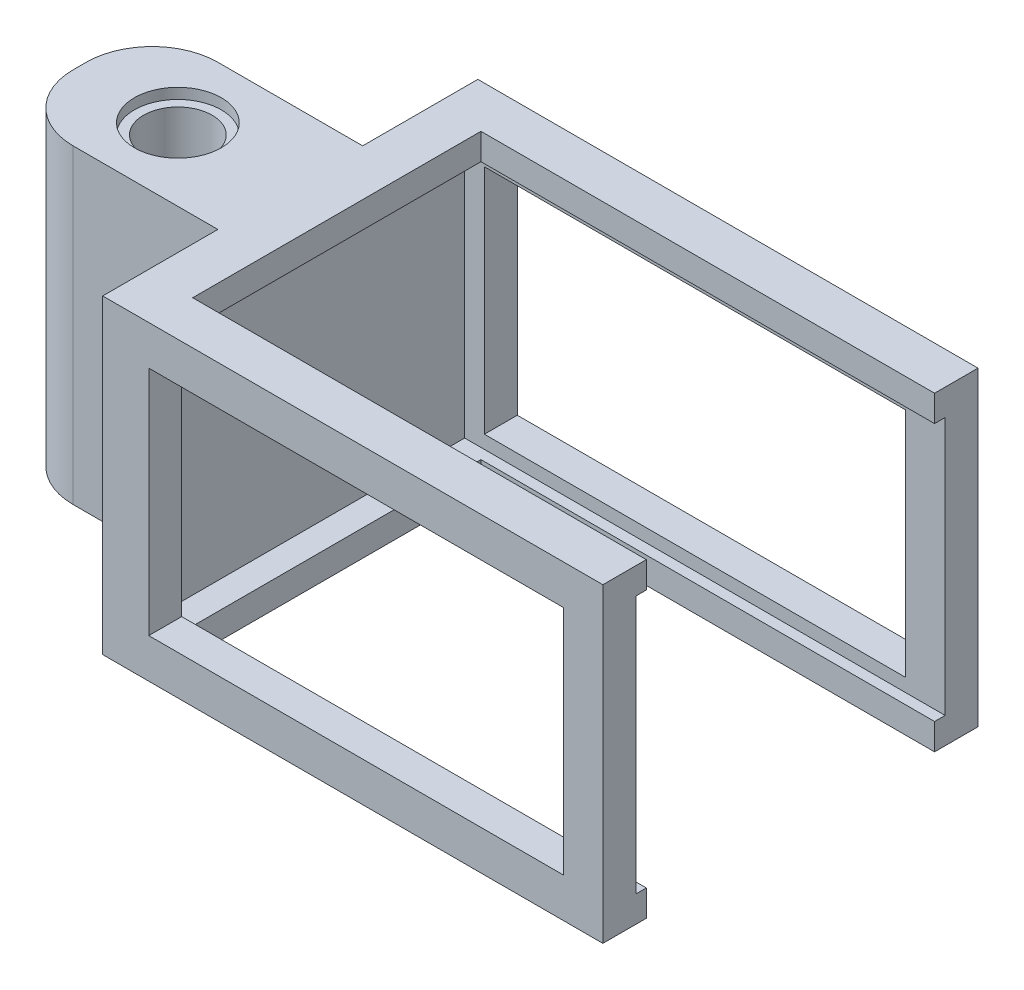
ISO-10303-21;
HEADER;
FILE_DESCRIPTION(('STEP AP214'),'2;1');
FILE_NAME('part.step','',(''),(''),'','','');
FILE_SCHEMA(('AUTOMOTIVE_DESIGN { 1 0 10303 214 1 1 1 1 }'));
ENDSEC;
DATA;
#1=APPLICATION_CONTEXT('core data for automotive mechanical design processes');
#2=APPLICATION_PROTOCOL_DEFINITION('international standard','automotive_design',2000,#1);
#3=PRODUCT_CONTEXT('',#1,'mechanical');
#4=PRODUCT('Part','Part','',(#3));
#5=PRODUCT_RELATED_PRODUCT_CATEGORY('part','',(#4));
#6=PRODUCT_DEFINITION_FORMATION('','',#4);
#7=PRODUCT_DEFINITION_CONTEXT('part definition',#1,'design');
#8=PRODUCT_DEFINITION('design','',#6,#7);
#9=PRODUCT_DEFINITION_SHAPE('','',#8);
#10=(LENGTH_UNIT() NAMED_UNIT(*) SI_UNIT(.MILLI.,.METRE.));
#11=(NAMED_UNIT(*) PLANE_ANGLE_UNIT() SI_UNIT($,.RADIAN.));
#12=(NAMED_UNIT(*) SI_UNIT($,.STERADIAN.) SOLID_ANGLE_UNIT());
#13=UNCERTAINTY_MEASURE_WITH_UNIT(LENGTH_MEASURE(1.E-05),#10,'distance_accuracy_value','');
#14=(GEOMETRIC_REPRESENTATION_CONTEXT(3) GLOBAL_UNCERTAINTY_ASSIGNED_CONTEXT((#13)) GLOBAL_UNIT_ASSIGNED_CONTEXT((#10,
#11,#12)) REPRESENTATION_CONTEXT('',''));
#15=CARTESIAN_POINT('',(0.,0.,0.));
#16=DIRECTION('',(0.,0.,1.));
#17=DIRECTION('',(1.,0.,0.));
#18=AXIS2_PLACEMENT_3D('',#15,#16,#17);
#19=CARTESIAN_POINT('',(0.,0.,2.5));
#20=DIRECTION('',(0.,0.,-1.));
#21=DIRECTION('',(-1.,0.,0.));
#22=AXIS2_PLACEMENT_3D('',#19,#20,#21);
#23=PLANE('',#22);
#24=DIRECTION('',(-1.,0.,0.));
#25=VECTOR('',#24,1.);
#26=CARTESIAN_POINT('',(38.,20.6,2.5));
#27=LINE('',#26,#25);
#28=CARTESIAN_POINT('',(35.,20.6,2.5));
#29=VERTEX_POINT('',#28);
#30=CARTESIAN_POINT('',(3.,20.6,2.5));
#31=VERTEX_POINT('',#30);
#32=EDGE_CURVE('E411',#29,#31,#27,.T.);
#33=ORIENTED_EDGE('',*,*,#32,.F.);
#34=DIRECTION('',(0.,-1.,0.));
#35=VECTOR('',#34,1.);
#36=CARTESIAN_POINT('',(35.,23.,2.5));
#37=LINE('',#36,#35);
#38=CARTESIAN_POINT('',(35.,3.,2.5));
#39=VERTEX_POINT('',#38);
#40=EDGE_CURVE('E348',#29,#39,#37,.T.);
#41=ORIENTED_EDGE('',*,*,#40,.T.);
#42=DIRECTION('',(1.,0.,0.));
#43=VECTOR('',#42,1.);
#44=CARTESIAN_POINT('',(38.,3.,2.5));
#45=LINE('',#44,#43);
#46=CARTESIAN_POINT('',(3.,3.,2.5));
#47=VERTEX_POINT('',#46);
#48=EDGE_CURVE('E415',#47,#39,#45,.T.);
#49=ORIENTED_EDGE('',*,*,#48,.F.);
#50=DIRECTION('',(0.,-1.,0.));
#51=VECTOR('',#50,1.);
#52=CARTESIAN_POINT('',(3.,20.6,2.5));
#53=LINE('',#52,#51);
#54=EDGE_CURVE('E423',#31,#47,#53,.T.);
#55=ORIENTED_EDGE('',*,*,#54,.F.);
#56=EDGE_LOOP('',(#33,#41,#49,#55));
#57=FACE_BOUND('',#56,.T.);
#58=DIRECTION('',(-1.,0.,0.));
#59=VECTOR('',#58,1.);
#60=CARTESIAN_POINT('',(0.,2.,2.5));
#61=LINE('',#60,#59);
#62=CARTESIAN_POINT('',(38.,2.,2.5));
#63=VERTEX_POINT('',#62);
#64=CARTESIAN_POINT('',(1.5,2.,2.5));
#65=VERTEX_POINT('',#64);
#66=EDGE_CURVE('E52',#63,#65,#61,.T.);
#67=ORIENTED_EDGE('',*,*,#66,.F.);
#68=DIRECTION('',(0.,1.,0.));
#69=VECTOR('',#68,1.);
#70=CARTESIAN_POINT('',(38.,0.,2.5));
#71=LINE('',#70,#69);
#72=CARTESIAN_POINT('',(38.,21.6,2.5));
#73=VERTEX_POINT('',#72);
#74=EDGE_CURVE('E432',#63,#73,#71,.T.);
#75=ORIENTED_EDGE('',*,*,#74,.T.);
#76=DIRECTION('',(1.,0.,0.));
#77=VECTOR('',#76,1.);
#78=CARTESIAN_POINT('',(0.,21.6,2.5));
#79=LINE('',#78,#77);
#80=CARTESIAN_POINT('',(1.5,21.6,2.5));
#81=VERTEX_POINT('',#80);
#82=EDGE_CURVE('E392',#81,#73,#79,.T.);
#83=ORIENTED_EDGE('',*,*,#82,.F.);
#84=DIRECTION('',(0.,1.,0.));
#85=VECTOR('',#84,1.);
#86=CARTESIAN_POINT('',(1.5,0.,2.5));
#87=LINE('',#86,#85);
#88=EDGE_CURVE('E402',#65,#81,#87,.T.);
#89=ORIENTED_EDGE('',*,*,#88,.F.);
#90=EDGE_LOOP('',(#67,#75,#83,#89));
#91=FACE_BOUND('',#90,.T.);
#92=ADVANCED_FACE('F37',(#57,#91),#23,.F.);
#93=CARTESIAN_POINT('',(3.53721509060322,-6.4,0.));
#94=DIRECTION('',(-1.,0.,0.));
#95=DIRECTION('',(0.,0.,1.));
#96=AXIS2_PLACEMENT_3D('',#93,#94,#95);
#97=PLANE('',#96);
#98=DIRECTION('',(0.,-1.,0.));
#99=VECTOR('',#98,1.);
#100=CARTESIAN_POINT('',(3.53721509060322,0.,3.3));
#101=LINE('',#100,#99);
#102=CARTESIAN_POINT('',(3.53721509060322,2.,3.3));
#103=VERTEX_POINT('',#102);
#104=CARTESIAN_POINT('',(3.53721509060322,0.,3.3));
#105=VERTEX_POINT('',#104);
#106=EDGE_CURVE('E60',#103,#105,#101,.T.);
#107=ORIENTED_EDGE('',*,*,#106,.F.);
#108=DIRECTION('',(0.,0.,-1.));
#109=VECTOR('',#108,1.);
#110=CARTESIAN_POINT('',(3.53721509060322,2.,28.5));
#111=LINE('',#110,#109);
#112=CARTESIAN_POINT('',(3.53721509060322,2.,25.2));
#113=VERTEX_POINT('',#112);
#114=EDGE_CURVE('E240',#113,#103,#111,.T.);
#115=ORIENTED_EDGE('',*,*,#114,.F.);
#116=DIRECTION('',(0.,1.,0.));
#117=VECTOR('',#116,1.);
#118=CARTESIAN_POINT('',(3.53721509060322,0.,25.2));
#119=LINE('',#118,#117);
#120=CARTESIAN_POINT('',(3.53721509060322,0.,25.2));
#121=VERTEX_POINT('',#120);
#122=EDGE_CURVE('E236',#121,#113,#119,.T.);
#123=ORIENTED_EDGE('',*,*,#122,.F.);
#124=DIRECTION('',(0.,0.,1.));
#125=VECTOR('',#124,1.);
#126=CARTESIAN_POINT('',(3.53721509060322,0.,2.5));
#127=LINE('',#126,#125);
#128=EDGE_CURVE('E232',#105,#121,#127,.T.);
#129=ORIENTED_EDGE('',*,*,#128,.F.);
#130=EDGE_LOOP('',(#107,#115,#123,#129));
#131=FACE_BOUND('',#130,.T.);
#132=ADVANCED_FACE('F234',(#131),#97,.F.);
#133=CARTESIAN_POINT('',(38.,3.,26.));
#134=DIRECTION('',(0.,0.,1.));
#135=DIRECTION('',(1.,0.,0.));
#136=AXIS2_PLACEMENT_3D('',#133,#134,#135);
#137=PLANE('',#136);
#138=DIRECTION('',(0.,-1.,0.));
#139=VECTOR('',#138,1.);
#140=CARTESIAN_POINT('',(35.,23.,26.));
#141=LINE('',#140,#139);
#142=CARTESIAN_POINT('',(35.,20.6,26.));
#143=VERTEX_POINT('',#142);
#144=CARTESIAN_POINT('',(35.,3.,26.));
#145=VERTEX_POINT('',#144);
#146=EDGE_CURVE('E342',#143,#145,#141,.T.);
#147=ORIENTED_EDGE('',*,*,#146,.F.);
#148=DIRECTION('',(1.,0.,0.));
#149=VECTOR('',#148,1.);
#150=CARTESIAN_POINT('',(0.,20.6,26.));
#151=LINE('',#150,#149);
#152=CARTESIAN_POINT('',(3.5,20.6,26.));
#153=VERTEX_POINT('',#152);
#154=EDGE_CURVE('E373',#153,#143,#151,.T.);
#155=ORIENTED_EDGE('',*,*,#154,.F.);
#156=DIRECTION('',(0.,1.,0.));
#157=VECTOR('',#156,1.);
#158=CARTESIAN_POINT('',(3.5,3.,26.));
#159=LINE('',#158,#157);
#160=CARTESIAN_POINT('',(3.5,3.,26.));
#161=VERTEX_POINT('',#160);
#162=EDGE_CURVE('E358',#161,#153,#159,.T.);
#163=ORIENTED_EDGE('',*,*,#162,.F.);
#164=DIRECTION('',(-1.,0.,0.));
#165=VECTOR('',#164,1.);
#166=CARTESIAN_POINT('',(38.,3.,26.));
#167=LINE('',#166,#165);
#168=EDGE_CURVE('E377',#145,#161,#167,.T.);
#169=ORIENTED_EDGE('',*,*,#168,.F.);
#170=EDGE_LOOP('',(#147,#155,#163,#169));
#171=FACE_BOUND('',#170,.T.);
#172=DIRECTION('',(0.,-1.,0.));
#173=VECTOR('',#172,1.);
#174=CARTESIAN_POINT('',(38.,3.,26.));
#175=LINE('',#174,#173);
#176=CARTESIAN_POINT('',(38.,21.6,26.));
#177=VERTEX_POINT('',#176);
#178=CARTESIAN_POINT('',(38.,2.,26.));
#179=VERTEX_POINT('',#178);
#180=EDGE_CURVE('E385',#177,#179,#175,.T.);
#181=ORIENTED_EDGE('',*,*,#180,.T.);
#182=DIRECTION('',(-1.,0.,0.));
#183=VECTOR('',#182,1.);
#184=CARTESIAN_POINT('',(38.,2.,26.));
#185=LINE('',#184,#183);
#186=CARTESIAN_POINT('',(1.5,2.,26.));
#187=VERTEX_POINT('',#186);
#188=EDGE_CURVE('E375',#179,#187,#185,.T.);
#189=ORIENTED_EDGE('',*,*,#188,.T.);
#190=DIRECTION('',(0.,-1.,0.));
#191=VECTOR('',#190,1.);
#192=CARTESIAN_POINT('',(1.5,3.,26.));
#193=LINE('',#192,#191);
#194=CARTESIAN_POINT('',(1.5,21.6,26.));
#195=VERTEX_POINT('',#194);
#196=EDGE_CURVE('E381',#195,#187,#193,.T.);
#197=ORIENTED_EDGE('',*,*,#196,.F.);
#198=DIRECTION('',(1.,0.,0.));
#199=VECTOR('',#198,1.);
#200=CARTESIAN_POINT('',(0.,21.6,26.));
#201=LINE('',#200,#199);
#202=EDGE_CURVE('E370',#195,#177,#201,.T.);
#203=ORIENTED_EDGE('',*,*,#202,.T.);
#204=EDGE_LOOP('',(#181,#189,#197,#203));
#205=FACE_BOUND('',#204,.T.);
#206=ADVANCED_FACE('F564',(#171,#205),#137,.F.);
#207=DIRECTION('',(0.,-1.,0.));
#208=VECTOR('',#207,1.);
#209=CARTESIAN_POINT('',(3.53721509060322,21.6,3.3));
#210=LINE('',#209,#208);
#211=CARTESIAN_POINT('',(3.53721509060322,23.6,3.3));
#212=VERTEX_POINT('',#211);
#213=CARTESIAN_POINT('',(3.53721509060322,21.6,3.3));
#214=VERTEX_POINT('',#213);
#215=EDGE_CURVE('E275',#212,#214,#210,.T.);
#216=ORIENTED_EDGE('',*,*,#215,.F.);
#217=DIRECTION('',(0.,0.,1.));
#218=VECTOR('',#217,1.);
#219=CARTESIAN_POINT('',(3.53721509060322,23.6,0.));
#220=LINE('',#219,#218);
#221=CARTESIAN_POINT('',(3.53721509060322,23.6,25.2));
#222=VERTEX_POINT('',#221);
#223=EDGE_CURVE('E241',#212,#222,#220,.T.);
#224=ORIENTED_EDGE('',*,*,#223,.T.);
#225=DIRECTION('',(0.,1.,0.));
#226=VECTOR('',#225,1.);
#227=CARTESIAN_POINT('',(3.53721509060322,21.6,25.2));
#228=LINE('',#227,#226);
#229=CARTESIAN_POINT('',(3.53721509060322,21.6,25.2));
#230=VERTEX_POINT('',#229);
#231=EDGE_CURVE('E289',#230,#222,#228,.T.);
#232=ORIENTED_EDGE('',*,*,#231,.F.);
#233=DIRECTION('',(0.,0.,1.));
#234=VECTOR('',#233,1.);
#235=CARTESIAN_POINT('',(3.53721509060322,21.6,28.5));
#236=LINE('',#235,#234);
#237=EDGE_CURVE('E356',#214,#230,#236,.T.);
#238=ORIENTED_EDGE('',*,*,#237,.F.);
#239=EDGE_LOOP('',(#216,#224,#232,#238));
#240=FACE_BOUND('',#239,.T.);
#241=ADVANCED_FACE('F522',(#240),#97,.F.);
#242=CARTESIAN_POINT('',(-8.54,-6.4,14.2500000000002));
#243=DIRECTION('',(0.,1.,0.));
#244=DIRECTION('',(0.,0.,1.));
#245=AXIS2_PLACEMENT_3D('',#242,#243,#244);
#246=CYLINDRICAL_SURFACE('',#245,2.6);
#247=CARTESIAN_POINT('',(-8.54,22.8,14.2500000000002));
#248=DIRECTION('',(0.,1.,0.));
#249=DIRECTION('',(0.,0.,1.));
#250=AXIS2_PLACEMENT_3D('',#247,#248,#249);
#251=CIRCLE('',#250,2.6);
#252=CARTESIAN_POINT('',(-8.54,22.8,16.8500000000002));
#253=VERTEX_POINT('',#252);
#254=EDGE_CURVE('E313',#253,#253,#251,.F.);
#255=ORIENTED_EDGE('',*,*,#254,.F.);
#256=EDGE_LOOP('',(#255));
#257=FACE_BOUND('',#256,.T.);
#258=CARTESIAN_POINT('',(-8.54,0.8,14.2500000000002));
#259=DIRECTION('',(0.,-1.,0.));
#260=DIRECTION('',(0.,0.,-1.));
#261=AXIS2_PLACEMENT_3D('',#258,#259,#260);
#262=CIRCLE('',#261,2.6);
#263=CARTESIAN_POINT('',(-8.54,0.8,11.6500000000002));
#264=VERTEX_POINT('',#263);
#265=EDGE_CURVE('E307',#264,#264,#262,.F.);
#266=ORIENTED_EDGE('',*,*,#265,.F.);
#267=EDGE_LOOP('',(#266));
#268=FACE_BOUND('',#267,.T.);
#269=ADVANCED_FACE('F609',(#257,#268),#246,.F.);
#270=CARTESIAN_POINT('',(0.,0.,2.5));
#271=DIRECTION('',(1.,0.,0.));
#272=DIRECTION('',(0.,0.,-1.));
#273=AXIS2_PLACEMENT_3D('',#270,#271,#272);
#274=PLANE('',#273);
#275=DIRECTION('',(0.,-1.,0.));
#276=VECTOR('',#275,1.);
#277=CARTESIAN_POINT('',(0.,0.,8.75));
#278=LINE('',#277,#276);
#279=CARTESIAN_POINT('',(0.,23.6,8.75));
#280=VERTEX_POINT('',#279);
#281=CARTESIAN_POINT('',(0.,0.,8.75));
#282=VERTEX_POINT('',#281);
#283=EDGE_CURVE('E320',#280,#282,#278,.T.);
#284=ORIENTED_EDGE('',*,*,#283,.F.);
#285=DIRECTION('',(0.,0.,-1.));
#286=VECTOR('',#285,1.);
#287=CARTESIAN_POINT('',(0.,23.6,2.5));
#288=LINE('',#287,#286);
#289=CARTESIAN_POINT('',(0.,23.6,0.));
#290=VERTEX_POINT('',#289);
#291=EDGE_CURVE('E434',#280,#290,#288,.T.);
#292=ORIENTED_EDGE('',*,*,#291,.T.);
#293=DIRECTION('',(0.,-1.,0.));
#294=VECTOR('',#293,1.);
#295=CARTESIAN_POINT('',(0.,0.,0.));
#296=LINE('',#295,#294);
#297=CARTESIAN_POINT('',(0.,0.,0.));
#298=VERTEX_POINT('',#297);
#299=EDGE_CURVE('E429',#290,#298,#296,.T.);
#300=ORIENTED_EDGE('',*,*,#299,.T.);
#301=DIRECTION('',(0.,0.,-1.));
#302=VECTOR('',#301,1.);
#303=CARTESIAN_POINT('',(0.,0.,2.5));
#304=LINE('',#303,#302);
#305=EDGE_CURVE('E452',#282,#298,#304,.T.);
#306=ORIENTED_EDGE('',*,*,#305,.F.);
#307=EDGE_LOOP('',(#284,#292,#300,#306));
#308=FACE_BOUND('',#307,.T.);
#309=ADVANCED_FACE('F541',(#308),#274,.F.);
#310=CARTESIAN_POINT('',(0.,3.,0.));
#311=DIRECTION('',(0.,1.,0.));
#312=DIRECTION('',(-1.,0.,0.));
#313=AXIS2_PLACEMENT_3D('',#310,#311,#312);
#314=PLANE('',#313);
#315=DIRECTION('',(1.,0.,0.));
#316=VECTOR('',#315,1.);
#317=CARTESIAN_POINT('',(38.,3.,28.5));
#318=LINE('',#317,#316);
#319=CARTESIAN_POINT('',(3.5,3.,28.5));
#320=VERTEX_POINT('',#319);
#321=CARTESIAN_POINT('',(35.,3.,28.5));
#322=VERTEX_POINT('',#321);
#323=EDGE_CURVE('E379',#320,#322,#318,.T.);
#324=ORIENTED_EDGE('',*,*,#323,.T.);
#325=DIRECTION('',(0.,0.,1.));
#326=VECTOR('',#325,1.);
#327=CARTESIAN_POINT('',(35.,3.,28.5));
#328=LINE('',#327,#326);
#329=EDGE_CURVE('E336',#145,#322,#328,.T.);
#330=ORIENTED_EDGE('',*,*,#329,.F.);
#331=ORIENTED_EDGE('',*,*,#168,.T.);
#332=DIRECTION('',(0.,0.,-1.));
#333=VECTOR('',#332,1.);
#334=CARTESIAN_POINT('',(3.5,3.,26.));
#335=LINE('',#334,#333);
#336=EDGE_CURVE('E367',#320,#161,#335,.T.);
#337=ORIENTED_EDGE('',*,*,#336,.F.);
#338=EDGE_LOOP('',(#324,#330,#331,#337));
#339=FACE_BOUND('',#338,.T.);
#340=ADVANCED_FACE('F616',(#339),#314,.T.);
#341=CARTESIAN_POINT('',(0.,20.6,0.));
#342=DIRECTION('',(0.,-1.,0.));
#343=DIRECTION('',(0.,0.,-1.));
#344=AXIS2_PLACEMENT_3D('',#341,#342,#343);
#345=PLANE('',#344);
#346=ORIENTED_EDGE('',*,*,#154,.T.);
#347=DIRECTION('',(0.,0.,1.));
#348=VECTOR('',#347,1.);
#349=CARTESIAN_POINT('',(35.,20.6,0.));
#350=LINE('',#349,#348);
#351=CARTESIAN_POINT('',(35.,20.6,28.5));
#352=VERTEX_POINT('',#351);
#353=EDGE_CURVE('E459',#143,#352,#350,.T.);
#354=ORIENTED_EDGE('',*,*,#353,.T.);
#355=DIRECTION('',(-1.,0.,0.));
#356=VECTOR('',#355,1.);
#357=CARTESIAN_POINT('',(0.,20.6,28.5));
#358=LINE('',#357,#356);
#359=CARTESIAN_POINT('',(3.5,20.6,28.5));
#360=VERTEX_POINT('',#359);
#361=EDGE_CURVE('E371',#352,#360,#358,.T.);
#362=ORIENTED_EDGE('',*,*,#361,.T.);
#363=DIRECTION('',(0.,0.,1.));
#364=VECTOR('',#363,1.);
#365=CARTESIAN_POINT('',(3.5,20.6,26.));
#366=LINE('',#365,#364);
#367=EDGE_CURVE('E361',#153,#360,#366,.T.);
#368=ORIENTED_EDGE('',*,*,#367,.F.);
#369=EDGE_LOOP('',(#346,#354,#362,#368));
#370=FACE_BOUND('',#369,.T.);
#371=ADVANCED_FACE('F635',(#370),#345,.T.);
#372=CARTESIAN_POINT('',(38.,3.,0.));
#373=DIRECTION('',(0.,-1.,0.));
#374=DIRECTION('',(0.,0.,-1.));
#375=AXIS2_PLACEMENT_3D('',#372,#373,#374);
#376=PLANE('',#375);
#377=DIRECTION('',(0.,0.,1.));
#378=VECTOR('',#377,1.);
#379=CARTESIAN_POINT('',(35.,3.,2.5));
#380=LINE('',#379,#378);
#381=CARTESIAN_POINT('',(35.,3.,0.));
#382=VERTEX_POINT('',#381);
#383=EDGE_CURVE('E345',#382,#39,#380,.T.);
#384=ORIENTED_EDGE('',*,*,#383,.F.);
#385=DIRECTION('',(1.,0.,0.));
#386=VECTOR('',#385,1.);
#387=CARTESIAN_POINT('',(38.,3.,0.));
#388=LINE('',#387,#386);
#389=CARTESIAN_POINT('',(3.,3.,0.));
#390=VERTEX_POINT('',#389);
#391=EDGE_CURVE('E418',#390,#382,#388,.T.);
#392=ORIENTED_EDGE('',*,*,#391,.F.);
#393=DIRECTION('',(0.,0.,1.));
#394=VECTOR('',#393,1.);
#395=CARTESIAN_POINT('',(3.,3.,0.));
#396=LINE('',#395,#394);
#397=EDGE_CURVE('E427',#390,#47,#396,.T.);
#398=ORIENTED_EDGE('',*,*,#397,.T.);
#399=ORIENTED_EDGE('',*,*,#48,.T.);
#400=EDGE_LOOP('',(#384,#392,#398,#399));
#401=FACE_BOUND('',#400,.T.);
#402=ADVANCED_FACE('F638',(#401),#376,.F.);
#403=CARTESIAN_POINT('',(38.,20.6,0.));
#404=DIRECTION('',(0.,1.,0.));
#405=DIRECTION('',(0.,0.,1.));
#406=AXIS2_PLACEMENT_3D('',#403,#404,#405);
#407=PLANE('',#406);
#408=DIRECTION('',(0.,0.,-1.));
#409=VECTOR('',#408,1.);
#410=CARTESIAN_POINT('',(35.,20.6,0.));
#411=LINE('',#410,#409);
#412=CARTESIAN_POINT('',(35.,20.6,0.));
#413=VERTEX_POINT('',#412);
#414=EDGE_CURVE('E456',#29,#413,#411,.T.);
#415=ORIENTED_EDGE('',*,*,#414,.F.);
#416=ORIENTED_EDGE('',*,*,#32,.T.);
#417=DIRECTION('',(0.,0.,1.));
#418=VECTOR('',#417,1.);
#419=CARTESIAN_POINT('',(3.,20.6,0.));
#420=LINE('',#419,#418);
#421=CARTESIAN_POINT('',(3.,20.6,0.));
#422=VERTEX_POINT('',#421);
#423=EDGE_CURVE('E421',#422,#31,#420,.T.);
#424=ORIENTED_EDGE('',*,*,#423,.F.);
#425=DIRECTION('',(-1.,0.,0.));
#426=VECTOR('',#425,1.);
#427=CARTESIAN_POINT('',(38.,20.6,0.));
#428=LINE('',#427,#426);
#429=EDGE_CURVE('E412',#413,#422,#428,.T.);
#430=ORIENTED_EDGE('',*,*,#429,.F.);
#431=EDGE_LOOP('',(#415,#416,#424,#430));
#432=FACE_BOUND('',#431,.T.);
#433=ADVANCED_FACE('F568',(#432),#407,.F.);
#434=CARTESIAN_POINT('',(38.,0.,2.5));
#435=DIRECTION('',(-1.,0.,0.));
#436=DIRECTION('',(0.,0.,1.));
#437=AXIS2_PLACEMENT_3D('',#434,#435,#436);
#438=PLANE('',#437);
#439=DIRECTION('',(0.,0.,-1.));
#440=VECTOR('',#439,1.);
#441=CARTESIAN_POINT('',(38.,23.6,2.5));
#442=LINE('',#441,#440);
#443=CARTESIAN_POINT('',(38.,23.6,28.5));
#444=VERTEX_POINT('',#443);
#445=CARTESIAN_POINT('',(38.,23.6,25.2));
#446=VERTEX_POINT('',#445);
#447=EDGE_CURVE('E448',#444,#446,#442,.T.);
#448=ORIENTED_EDGE('',*,*,#447,.F.);
#449=DIRECTION('',(0.,1.,0.));
#450=VECTOR('',#449,1.);
#451=CARTESIAN_POINT('',(38.,0.,28.5));
#452=LINE('',#451,#450);
#453=CARTESIAN_POINT('',(38.,0.,28.5));
#454=VERTEX_POINT('',#453);
#455=EDGE_CURVE('E398',#454,#444,#452,.T.);
#456=ORIENTED_EDGE('',*,*,#455,.F.);
#457=DIRECTION('',(0.,0.,-1.));
#458=VECTOR('',#457,1.);
#459=CARTESIAN_POINT('',(38.,0.,2.5));
#460=LINE('',#459,#458);
#461=CARTESIAN_POINT('',(38.,0.,25.2));
#462=VERTEX_POINT('',#461);
#463=EDGE_CURVE('E450',#454,#462,#460,.T.);
#464=ORIENTED_EDGE('',*,*,#463,.T.);
#465=DIRECTION('',(0.,-1.,0.));
#466=VECTOR('',#465,1.);
#467=CARTESIAN_POINT('',(38.,0.,25.2));
#468=LINE('',#467,#466);
#469=CARTESIAN_POINT('',(38.,2.,25.2));
#470=VERTEX_POINT('',#469);
#471=EDGE_CURVE('E267',#470,#462,#468,.T.);
#472=ORIENTED_EDGE('',*,*,#471,.F.);
#473=DIRECTION('',(0.,0.,1.));
#474=VECTOR('',#473,1.);
#475=CARTESIAN_POINT('',(38.,2.,25.2));
#476=LINE('',#475,#474);
#477=EDGE_CURVE('E272',#470,#179,#476,.T.);
#478=ORIENTED_EDGE('',*,*,#477,.T.);
#479=ORIENTED_EDGE('',*,*,#180,.F.);
#480=DIRECTION('',(0.,0.,1.));
#481=VECTOR('',#480,1.);
#482=CARTESIAN_POINT('',(38.,21.6,25.2));
#483=LINE('',#482,#481);
#484=CARTESIAN_POINT('',(38.,21.6,25.2));
#485=VERTEX_POINT('',#484);
#486=EDGE_CURVE('E300',#485,#177,#483,.T.);
#487=ORIENTED_EDGE('',*,*,#486,.F.);
#488=DIRECTION('',(0.,-1.,0.));
#489=VECTOR('',#488,1.);
#490=CARTESIAN_POINT('',(38.,21.6,25.2));
#491=LINE('',#490,#489);
#492=EDGE_CURVE('E295',#446,#485,#491,.T.);
#493=ORIENTED_EDGE('',*,*,#492,.F.);
#494=EDGE_LOOP('',(#448,#456,#464,#472,#478,#479,#487,#493));
#495=FACE_BOUND('',#494,.T.);
#496=ADVANCED_FACE('F514',(#495),#438,.F.);
#497=CARTESIAN_POINT('',(1.5,0.,28.5));
#498=DIRECTION('',(-1.,0.,0.));
#499=DIRECTION('',(0.,0.,1.));
#500=AXIS2_PLACEMENT_3D('',#497,#498,#499);
#501=PLANE('',#500);
#502=DIRECTION('',(0.,0.,-1.));
#503=VECTOR('',#502,1.);
#504=CARTESIAN_POINT('',(1.5,21.6,28.5));
#505=LINE('',#504,#503);
#506=EDGE_CURVE('E400',#195,#81,#505,.T.);
#507=ORIENTED_EDGE('',*,*,#506,.F.);
#508=ORIENTED_EDGE('',*,*,#196,.T.);
#509=DIRECTION('',(0.,0.,-1.));
#510=VECTOR('',#509,1.);
#511=CARTESIAN_POINT('',(1.5,2.,28.5));
#512=LINE('',#511,#510);
#513=EDGE_CURVE('E408',#187,#65,#512,.T.);
#514=ORIENTED_EDGE('',*,*,#513,.T.);
#515=ORIENTED_EDGE('',*,*,#88,.T.);
#516=EDGE_LOOP('',(#507,#508,#514,#515));
#517=FACE_BOUND('',#516,.T.);
#518=ADVANCED_FACE('F648',(#517),#501,.F.);
#519=CARTESIAN_POINT('',(0.,21.6,28.5));
#520=DIRECTION('',(0.,1.,0.));
#521=DIRECTION('',(0.,0.,1.));
#522=AXIS2_PLACEMENT_3D('',#519,#520,#521);
#523=PLANE('',#522);
#524=ORIENTED_EDGE('',*,*,#82,.T.);
#525=DIRECTION('',(0.,0.,-1.));
#526=VECTOR('',#525,1.);
#527=CARTESIAN_POINT('',(38.,21.6,3.3));
#528=LINE('',#527,#526);
#529=CARTESIAN_POINT('',(38.,21.6,3.3));
#530=VERTEX_POINT('',#529);
#531=EDGE_CURVE('E286',#530,#73,#528,.T.);
#532=ORIENTED_EDGE('',*,*,#531,.F.);
#533=DIRECTION('',(1.,0.,0.));
#534=VECTOR('',#533,1.);
#535=CARTESIAN_POINT('',(3.53721509060322,21.6,3.3));
#536=LINE('',#535,#534);
#537=EDGE_CURVE('E278',#214,#530,#536,.T.);
#538=ORIENTED_EDGE('',*,*,#537,.F.);
#539=ORIENTED_EDGE('',*,*,#237,.T.);
#540=DIRECTION('',(-1.,0.,0.));
#541=VECTOR('',#540,1.);
#542=CARTESIAN_POINT('',(3.53721509060322,21.6,25.2));
#543=LINE('',#542,#541);
#544=EDGE_CURVE('E297',#485,#230,#543,.T.);
#545=ORIENTED_EDGE('',*,*,#544,.F.);
#546=ORIENTED_EDGE('',*,*,#486,.T.);
#547=ORIENTED_EDGE('',*,*,#202,.F.);
#548=ORIENTED_EDGE('',*,*,#506,.T.);
#549=EDGE_LOOP('',(#524,#532,#538,#539,#545,#546,#547,#548));
#550=FACE_BOUND('',#549,.T.);
#551=ADVANCED_FACE('F519',(#550),#523,.F.);
#552=CARTESIAN_POINT('',(0.,2.,28.5));
#553=DIRECTION('',(0.,-1.,0.));
#554=DIRECTION('',(1.,0.,0.));
#555=AXIS2_PLACEMENT_3D('',#552,#553,#554);
#556=PLANE('',#555);
#557=ORIENTED_EDGE('',*,*,#188,.F.);
#558=ORIENTED_EDGE('',*,*,#477,.F.);
#559=DIRECTION('',(1.,0.,0.));
#560=VECTOR('',#559,1.);
#561=CARTESIAN_POINT('',(3.53721509060322,2.,25.2));
#562=LINE('',#561,#560);
#563=EDGE_CURVE('E265',#113,#470,#562,.T.);
#564=ORIENTED_EDGE('',*,*,#563,.F.);
#565=ORIENTED_EDGE('',*,*,#114,.T.);
#566=DIRECTION('',(-1.,0.,0.));
#567=VECTOR('',#566,1.);
#568=CARTESIAN_POINT('',(3.53721509060322,2.,3.3));
#569=LINE('',#568,#567);
#570=CARTESIAN_POINT('',(38.,2.,3.3));
#571=VERTEX_POINT('',#570);
#572=EDGE_CURVE('E256',#571,#103,#569,.T.);
#573=ORIENTED_EDGE('',*,*,#572,.F.);
#574=DIRECTION('',(0.,0.,-1.));
#575=VECTOR('',#574,1.);
#576=CARTESIAN_POINT('',(38.,2.,3.3));
#577=LINE('',#576,#575);
#578=EDGE_CURVE('E261',#571,#63,#577,.T.);
#579=ORIENTED_EDGE('',*,*,#578,.T.);
#580=ORIENTED_EDGE('',*,*,#66,.T.);
#581=ORIENTED_EDGE('',*,*,#513,.F.);
#582=EDGE_LOOP('',(#557,#558,#564,#565,#573,#579,#580,#581));
#583=FACE_BOUND('',#582,.T.);
#584=ADVANCED_FACE('F583',(#583),#556,.F.);
#585=CARTESIAN_POINT('',(0.,23.6,28.5));
#586=VERTEX_POINT('',#585);
#587=CARTESIAN_POINT('',(0.,23.6,19.75));
#588=VERTEX_POINT('',#587);
#589=EDGE_CURVE('E444',#586,#588,#288,.T.);
#590=ORIENTED_EDGE('',*,*,#589,.T.);
#591=DIRECTION('',(0.,-1.,0.));
#592=VECTOR('',#591,1.);
#593=CARTESIAN_POINT('',(0.,0.,19.75));
#594=LINE('',#593,#592);
#595=CARTESIAN_POINT('',(0.,0.,19.75));
#596=VERTEX_POINT('',#595);
#597=EDGE_CURVE('E324',#588,#596,#594,.T.);
#598=ORIENTED_EDGE('',*,*,#597,.T.);
#599=CARTESIAN_POINT('',(0.,0.,28.5));
#600=VERTEX_POINT('',#599);
#601=EDGE_CURVE('E453',#600,#596,#304,.T.);
#602=ORIENTED_EDGE('',*,*,#601,.F.);
#603=DIRECTION('',(0.,-1.,0.));
#604=VECTOR('',#603,1.);
#605=CARTESIAN_POINT('',(0.,0.,28.5));
#606=LINE('',#605,#604);
#607=EDGE_CURVE('E391',#586,#600,#606,.T.);
#608=ORIENTED_EDGE('',*,*,#607,.F.);
#609=EDGE_LOOP('',(#590,#598,#602,#608));
#610=FACE_BOUND('',#609,.T.);
#611=ADVANCED_FACE('F500',(#610),#274,.F.);
#612=CARTESIAN_POINT('',(0.,0.,2.5));
#613=DIRECTION('',(0.,1.,0.));
#614=DIRECTION('',(0.,0.,1.));
#615=AXIS2_PLACEMENT_3D('',#612,#613,#614);
#616=PLANE('',#615);
#617=CARTESIAN_POINT('',(-8.54,0.,14.2500000000002));
#618=DIRECTION('',(0.,-1.,0.));
#619=DIRECTION('',(0.,0.,-1.));
#620=AXIS2_PLACEMENT_3D('',#617,#618,#619);
#621=CIRCLE('',#620,3.3);
#622=CARTESIAN_POINT('',(-8.54,0.,10.9500000000002));
#623=VERTEX_POINT('',#622);
#624=EDGE_CURVE('E303',#623,#623,#621,.T.);
#625=ORIENTED_EDGE('',*,*,#624,.F.);
#626=EDGE_LOOP('',(#625));
#627=FACE_BOUND('',#626,.T.);
#628=DIRECTION('',(1.,0.,0.));
#629=VECTOR('',#628,1.);
#630=CARTESIAN_POINT('',(-16.,0.,19.75));
#631=LINE('',#630,#629);
#632=CARTESIAN_POINT('',(-11.,0.,19.75));
#633=VERTEX_POINT('',#632);
#634=EDGE_CURVE('E323',#633,#596,#631,.T.);
#635=ORIENTED_EDGE('',*,*,#634,.F.);
#636=CARTESIAN_POINT('',(-11.,0.,14.75));
#637=DIRECTION('',(0.,1.,0.));
#638=DIRECTION('',(0.,0.,1.));
#639=AXIS2_PLACEMENT_3D('',#636,#637,#638);
#640=CIRCLE('',#639,5.);
#641=CARTESIAN_POINT('',(-16.,0.,14.75));
#642=VERTEX_POINT('',#641);
#643=EDGE_CURVE('E479',#633,#642,#640,.F.);
#644=ORIENTED_EDGE('',*,*,#643,.T.);
#645=DIRECTION('',(0.,0.,1.));
#646=VECTOR('',#645,1.);
#647=CARTESIAN_POINT('',(-16.,0.,0.));
#648=LINE('',#647,#646);
#649=CARTESIAN_POINT('',(-16.,0.,13.75));
#650=VERTEX_POINT('',#649);
#651=EDGE_CURVE('E319',#650,#642,#648,.T.);
#652=ORIENTED_EDGE('',*,*,#651,.F.);
#653=CARTESIAN_POINT('',(-11.,0.,13.75));
#654=DIRECTION('',(0.,1.,0.));
#655=DIRECTION('',(0.,0.,1.));
#656=AXIS2_PLACEMENT_3D('',#653,#654,#655);
#657=CIRCLE('',#656,5.);
#658=CARTESIAN_POINT('',(-11.,0.,8.75));
#659=VERTEX_POINT('',#658);
#660=EDGE_CURVE('E469',#650,#659,#657,.F.);
#661=ORIENTED_EDGE('',*,*,#660,.T.);
#662=DIRECTION('',(1.,0.,0.));
#663=VECTOR('',#662,1.);
#664=CARTESIAN_POINT('',(-16.,0.,8.75));
#665=LINE('',#664,#663);
#666=EDGE_CURVE('E330',#659,#282,#665,.T.);
#667=ORIENTED_EDGE('',*,*,#666,.T.);
#668=ORIENTED_EDGE('',*,*,#305,.T.);
#669=DIRECTION('',(1.,0.,0.));
#670=VECTOR('',#669,1.);
#671=CARTESIAN_POINT('',(0.,0.,0.));
#672=LINE('',#671,#670);
#673=CARTESIAN_POINT('',(38.,0.,0.));
#674=VERTEX_POINT('',#673);
#675=EDGE_CURVE('E438',#298,#674,#672,.T.);
#676=ORIENTED_EDGE('',*,*,#675,.T.);
#677=CARTESIAN_POINT('',(38.,0.,3.3));
#678=VERTEX_POINT('',#677);
#679=EDGE_CURVE('E248',#678,#674,#460,.T.);
#680=ORIENTED_EDGE('',*,*,#679,.F.);
#681=DIRECTION('',(1.,0.,0.));
#682=VECTOR('',#681,1.);
#683=CARTESIAN_POINT('',(3.53721509060322,0.,3.3));
#684=LINE('',#683,#682);
#685=EDGE_CURVE('E244',#105,#678,#684,.T.);
#686=ORIENTED_EDGE('',*,*,#685,.F.);
#687=ORIENTED_EDGE('',*,*,#128,.T.);
#688=DIRECTION('',(-1.,0.,0.));
#689=VECTOR('',#688,1.);
#690=CARTESIAN_POINT('',(3.53721509060322,0.,25.2));
#691=LINE('',#690,#689);
#692=EDGE_CURVE('E270',#462,#121,#691,.T.);
#693=ORIENTED_EDGE('',*,*,#692,.F.);
#694=ORIENTED_EDGE('',*,*,#463,.F.);
#695=DIRECTION('',(1.,0.,0.));
#696=VECTOR('',#695,1.);
#697=CARTESIAN_POINT('',(0.,0.,28.5));
#698=LINE('',#697,#696);
#699=EDGE_CURVE('E395',#600,#454,#698,.T.);
#700=ORIENTED_EDGE('',*,*,#699,.F.);
#701=ORIENTED_EDGE('',*,*,#601,.T.);
#702=EDGE_LOOP('',(#635,#644,#652,#661,#667,#668,#676,#680,#686,#687,#693,#694,#700,#701));
#703=FACE_BOUND('',#702,.T.);
#704=ADVANCED_FACE('F246',(#627,#703),#616,.F.);
#705=CARTESIAN_POINT('',(38.,23.6,3.3));
#706=VERTEX_POINT('',#705);
#707=CARTESIAN_POINT('',(38.,23.6,0.));
#708=VERTEX_POINT('',#707);
#709=EDGE_CURVE('E447',#706,#708,#442,.T.);
#710=ORIENTED_EDGE('',*,*,#709,.F.);
#711=DIRECTION('',(0.,1.,0.));
#712=VECTOR('',#711,1.);
#713=CARTESIAN_POINT('',(38.,21.6,3.3));
#714=LINE('',#713,#712);
#715=EDGE_CURVE('E280',#530,#706,#714,.T.);
#716=ORIENTED_EDGE('',*,*,#715,.F.);
#717=ORIENTED_EDGE('',*,*,#531,.T.);
#718=ORIENTED_EDGE('',*,*,#74,.F.);
#719=ORIENTED_EDGE('',*,*,#578,.F.);
#720=DIRECTION('',(0.,1.,0.));
#721=VECTOR('',#720,1.);
#722=CARTESIAN_POINT('',(38.,0.,3.3));
#723=LINE('',#722,#721);
#724=EDGE_CURVE('E251',#678,#571,#723,.T.);
#725=ORIENTED_EDGE('',*,*,#724,.F.);
#726=ORIENTED_EDGE('',*,*,#679,.T.);
#727=DIRECTION('',(0.,1.,0.));
#728=VECTOR('',#727,1.);
#729=CARTESIAN_POINT('',(38.,0.,0.));
#730=LINE('',#729,#728);
#731=EDGE_CURVE('E440',#674,#708,#730,.T.);
#732=ORIENTED_EDGE('',*,*,#731,.T.);
#733=EDGE_LOOP('',(#710,#716,#717,#718,#719,#725,#726,#732));
#734=FACE_BOUND('',#733,.T.);
#735=ADVANCED_FACE('F530',(#734),#438,.F.);
#736=CARTESIAN_POINT('',(0.,23.6,2.5));
#737=DIRECTION('',(0.,-1.,0.));
#738=DIRECTION('',(0.,0.,-1.));
#739=AXIS2_PLACEMENT_3D('',#736,#737,#738);
#740=PLANE('',#739);
#741=CARTESIAN_POINT('',(-8.54,23.6,14.2500000000002));
#742=DIRECTION('',(0.,1.,0.));
#743=DIRECTION('',(0.,0.,1.));
#744=AXIS2_PLACEMENT_3D('',#741,#742,#743);
#745=CIRCLE('',#744,3.3);
#746=CARTESIAN_POINT('',(-8.54,23.6,17.5500000000002));
#747=VERTEX_POINT('',#746);
#748=EDGE_CURVE('E314',#747,#747,#745,.T.);
#749=ORIENTED_EDGE('',*,*,#748,.F.);
#750=EDGE_LOOP('',(#749));
#751=FACE_BOUND('',#750,.T.);
#752=DIRECTION('',(0.,0.,-1.));
#753=VECTOR('',#752,1.);
#754=CARTESIAN_POINT('',(-16.,23.6,0.));
#755=LINE('',#754,#753);
#756=CARTESIAN_POINT('',(-16.,23.6,14.75));
#757=VERTEX_POINT('',#756);
#758=CARTESIAN_POINT('',(-16.,23.6,13.75));
#759=VERTEX_POINT('',#758);
#760=EDGE_CURVE('E317',#757,#759,#755,.T.);
#761=ORIENTED_EDGE('',*,*,#760,.F.);
#762=CARTESIAN_POINT('',(-11.,23.6,14.75));
#763=DIRECTION('',(0.,-1.,0.));
#764=DIRECTION('',(0.,0.,-1.));
#765=AXIS2_PLACEMENT_3D('',#762,#763,#764);
#766=CIRCLE('',#765,5.);
#767=CARTESIAN_POINT('',(-11.,23.6,19.75));
#768=VERTEX_POINT('',#767);
#769=EDGE_CURVE('E11',#757,#768,#766,.F.);
#770=ORIENTED_EDGE('',*,*,#769,.T.);
#771=DIRECTION('',(1.,0.,0.));
#772=VECTOR('',#771,1.);
#773=CARTESIAN_POINT('',(-16.,23.6,19.75));
#774=LINE('',#773,#772);
#775=EDGE_CURVE('E334',#768,#588,#774,.T.);
#776=ORIENTED_EDGE('',*,*,#775,.T.);
#777=ORIENTED_EDGE('',*,*,#589,.F.);
#778=DIRECTION('',(-1.,0.,0.));
#779=VECTOR('',#778,1.);
#780=CARTESIAN_POINT('',(0.,23.6,28.5));
#781=LINE('',#780,#779);
#782=EDGE_CURVE('E388',#444,#586,#781,.T.);
#783=ORIENTED_EDGE('',*,*,#782,.F.);
#784=ORIENTED_EDGE('',*,*,#447,.T.);
#785=DIRECTION('',(1.,0.,0.));
#786=VECTOR('',#785,1.);
#787=CARTESIAN_POINT('',(3.53721509060322,23.6,25.2));
#788=LINE('',#787,#786);
#789=EDGE_CURVE('E292',#222,#446,#788,.T.);
#790=ORIENTED_EDGE('',*,*,#789,.F.);
#791=ORIENTED_EDGE('',*,*,#223,.F.);
#792=DIRECTION('',(-1.,0.,0.));
#793=VECTOR('',#792,1.);
#794=CARTESIAN_POINT('',(3.53721509060322,23.6,3.3));
#795=LINE('',#794,#793);
#796=EDGE_CURVE('E283',#706,#212,#795,.T.);
#797=ORIENTED_EDGE('',*,*,#796,.F.);
#798=ORIENTED_EDGE('',*,*,#709,.T.);
#799=DIRECTION('',(-1.,0.,0.));
#800=VECTOR('',#799,1.);
#801=CARTESIAN_POINT('',(0.,23.6,0.));
#802=LINE('',#801,#800);
#803=EDGE_CURVE('E435',#708,#290,#802,.T.);
#804=ORIENTED_EDGE('',*,*,#803,.T.);
#805=ORIENTED_EDGE('',*,*,#291,.F.);
#806=DIRECTION('',(1.,0.,0.));
#807=VECTOR('',#806,1.);
#808=CARTESIAN_POINT('',(-16.,23.6,8.75));
#809=LINE('',#808,#807);
#810=CARTESIAN_POINT('',(-11.,23.6,8.75));
#811=VERTEX_POINT('',#810);
#812=EDGE_CURVE('E332',#811,#280,#809,.T.);
#813=ORIENTED_EDGE('',*,*,#812,.F.);
#814=CARTESIAN_POINT('',(-11.,23.6,13.75));
#815=DIRECTION('',(0.,-1.,0.));
#816=DIRECTION('',(0.,0.,-1.));
#817=AXIS2_PLACEMENT_3D('',#814,#815,#816);
#818=CIRCLE('',#817,5.);
#819=EDGE_CURVE('E473',#811,#759,#818,.F.);
#820=ORIENTED_EDGE('',*,*,#819,.T.);
#821=EDGE_LOOP('',(#761,#770,#776,#777,#783,#784,#790,#791,#797,#798,#804,#805,#813,#820));
#822=FACE_BOUND('',#821,.T.);
#823=ADVANCED_FACE('F488',(#751,#822),#740,.F.);
#824=CARTESIAN_POINT('',(0.,0.,0.));
#825=DIRECTION('',(0.,0.,-1.));
#826=DIRECTION('',(-1.,0.,0.));
#827=AXIS2_PLACEMENT_3D('',#824,#825,#826);
#828=PLANE('',#827);
#829=DIRECTION('',(0.,-1.,0.));
#830=VECTOR('',#829,1.);
#831=CARTESIAN_POINT('',(35.,23.,0.));
#832=LINE('',#831,#830);
#833=EDGE_CURVE('E351',#413,#382,#832,.T.);
#834=ORIENTED_EDGE('',*,*,#833,.F.);
#835=ORIENTED_EDGE('',*,*,#429,.T.);
#836=DIRECTION('',(0.,-1.,0.));
#837=VECTOR('',#836,1.);
#838=CARTESIAN_POINT('',(3.,20.6,0.));
#839=LINE('',#838,#837);
#840=EDGE_CURVE('E414',#422,#390,#839,.T.);
#841=ORIENTED_EDGE('',*,*,#840,.T.);
#842=ORIENTED_EDGE('',*,*,#391,.T.);
#843=EDGE_LOOP('',(#834,#835,#841,#842));
#844=FACE_BOUND('',#843,.T.);
#845=ORIENTED_EDGE('',*,*,#803,.F.);
#846=ORIENTED_EDGE('',*,*,#731,.F.);
#847=ORIENTED_EDGE('',*,*,#675,.F.);
#848=ORIENTED_EDGE('',*,*,#299,.F.);
#849=EDGE_LOOP('',(#845,#846,#847,#848));
#850=FACE_BOUND('',#849,.T.);
#851=ADVANCED_FACE('F536',(#844,#850),#828,.T.);
#852=CARTESIAN_POINT('',(3.,20.6,0.));
#853=DIRECTION('',(-1.,0.,0.));
#854=DIRECTION('',(0.,0.,1.));
#855=AXIS2_PLACEMENT_3D('',#852,#853,#854);
#856=PLANE('',#855);
#857=ORIENTED_EDGE('',*,*,#54,.T.);
#858=ORIENTED_EDGE('',*,*,#397,.F.);
#859=ORIENTED_EDGE('',*,*,#840,.F.);
#860=ORIENTED_EDGE('',*,*,#423,.T.);
#861=EDGE_LOOP('',(#857,#858,#859,#860));
#862=FACE_BOUND('',#861,.T.);
#863=ADVANCED_FACE('F572',(#862),#856,.F.);
#864=CARTESIAN_POINT('',(0.,0.,28.5));
#865=DIRECTION('',(0.,0.,1.));
#866=DIRECTION('',(1.,0.,0.));
#867=AXIS2_PLACEMENT_3D('',#864,#865,#866);
#868=PLANE('',#867);
#869=ORIENTED_EDGE('',*,*,#361,.F.);
#870=DIRECTION('',(0.,-1.,0.));
#871=VECTOR('',#870,1.);
#872=CARTESIAN_POINT('',(35.,23.,28.5));
#873=LINE('',#872,#871);
#874=EDGE_CURVE('E339',#352,#322,#873,.T.);
#875=ORIENTED_EDGE('',*,*,#874,.T.);
#876=ORIENTED_EDGE('',*,*,#323,.F.);
#877=DIRECTION('',(0.,-1.,0.));
#878=VECTOR('',#877,1.);
#879=CARTESIAN_POINT('',(3.5,3.,28.5));
#880=LINE('',#879,#878);
#881=EDGE_CURVE('E364',#360,#320,#880,.T.);
#882=ORIENTED_EDGE('',*,*,#881,.F.);
#883=EDGE_LOOP('',(#869,#875,#876,#882));
#884=FACE_BOUND('',#883,.T.);
#885=ORIENTED_EDGE('',*,*,#455,.T.);
#886=ORIENTED_EDGE('',*,*,#782,.T.);
#887=ORIENTED_EDGE('',*,*,#607,.T.);
#888=ORIENTED_EDGE('',*,*,#699,.T.);
#889=EDGE_LOOP('',(#885,#886,#887,#888));
#890=FACE_BOUND('',#889,.T.);
#891=ADVANCED_FACE('F502',(#884,#890),#868,.T.);
#892=CARTESIAN_POINT('',(3.5,0.,0.));
#893=DIRECTION('',(1.,0.,0.));
#894=DIRECTION('',(0.,0.,-1.));
#895=AXIS2_PLACEMENT_3D('',#892,#893,#894);
#896=PLANE('',#895);
#897=ORIENTED_EDGE('',*,*,#162,.T.);
#898=ORIENTED_EDGE('',*,*,#367,.T.);
#899=ORIENTED_EDGE('',*,*,#881,.T.);
#900=ORIENTED_EDGE('',*,*,#336,.T.);
#901=EDGE_LOOP('',(#897,#898,#899,#900));
#902=FACE_BOUND('',#901,.T.);
#903=ADVANCED_FACE('F631',(#902),#896,.T.);
#904=CARTESIAN_POINT('',(35.,23.,2.5));
#905=DIRECTION('',(1.,0.,0.));
#906=DIRECTION('',(0.,0.,-1.));
#907=AXIS2_PLACEMENT_3D('',#904,#905,#906);
#908=PLANE('',#907);
#909=ORIENTED_EDGE('',*,*,#40,.F.);
#910=ORIENTED_EDGE('',*,*,#414,.T.);
#911=ORIENTED_EDGE('',*,*,#833,.T.);
#912=ORIENTED_EDGE('',*,*,#383,.T.);
#913=EDGE_LOOP('',(#909,#910,#911,#912));
#914=FACE_BOUND('',#913,.T.);
#915=ADVANCED_FACE('F629',(#914),#908,.F.);
#916=CARTESIAN_POINT('',(35.,23.,28.5));
#917=DIRECTION('',(1.,0.,0.));
#918=DIRECTION('',(0.,1.,0.));
#919=AXIS2_PLACEMENT_3D('',#916,#917,#918);
#920=PLANE('',#919);
#921=ORIENTED_EDGE('',*,*,#353,.F.);
#922=ORIENTED_EDGE('',*,*,#146,.T.);
#923=ORIENTED_EDGE('',*,*,#329,.T.);
#924=ORIENTED_EDGE('',*,*,#874,.F.);
#925=EDGE_LOOP('',(#921,#922,#923,#924));
#926=FACE_BOUND('',#925,.T.);
#927=ADVANCED_FACE('F556',(#926),#920,.F.);
#928=CARTESIAN_POINT('',(-16.,0.,19.75));
#929=DIRECTION('',(0.,0.,1.));
#930=DIRECTION('',(0.,-1.,0.));
#931=AXIS2_PLACEMENT_3D('',#928,#929,#930);
#932=PLANE('',#931);
#933=ORIENTED_EDGE('',*,*,#775,.F.);
#934=DIRECTION('',(0.,-1.,0.));
#935=VECTOR('',#934,1.);
#936=CARTESIAN_POINT('',(-11.,0.,19.75));
#937=LINE('',#936,#935);
#938=EDGE_CURVE('E476',#768,#633,#937,.T.);
#939=ORIENTED_EDGE('',*,*,#938,.T.);
#940=ORIENTED_EDGE('',*,*,#634,.T.);
#941=ORIENTED_EDGE('',*,*,#597,.F.);
#942=EDGE_LOOP('',(#933,#939,#940,#941));
#943=FACE_BOUND('',#942,.T.);
#944=ADVANCED_FACE('F495',(#943),#932,.T.);
#945=CARTESIAN_POINT('',(-16.,0.,8.75));
#946=DIRECTION('',(0.,0.,1.));
#947=DIRECTION('',(0.,-1.,0.));
#948=AXIS2_PLACEMENT_3D('',#945,#946,#947);
#949=PLANE('',#948);
#950=ORIENTED_EDGE('',*,*,#666,.F.);
#951=DIRECTION('',(0.,-1.,0.));
#952=VECTOR('',#951,1.);
#953=CARTESIAN_POINT('',(-11.,23.6,8.75));
#954=LINE('',#953,#952);
#955=EDGE_CURVE('E471',#659,#811,#954,.F.);
#956=ORIENTED_EDGE('',*,*,#955,.T.);
#957=ORIENTED_EDGE('',*,*,#812,.T.);
#958=ORIENTED_EDGE('',*,*,#283,.T.);
#959=EDGE_LOOP('',(#950,#956,#957,#958));
#960=FACE_BOUND('',#959,.T.);
#961=ADVANCED_FACE('F547',(#960),#949,.F.);
#962=CARTESIAN_POINT('',(-16.,0.,0.));
#963=DIRECTION('',(-1.,0.,0.));
#964=DIRECTION('',(0.,0.,1.));
#965=AXIS2_PLACEMENT_3D('',#962,#963,#964);
#966=PLANE('',#965);
#967=ORIENTED_EDGE('',*,*,#651,.T.);
#968=DIRECTION('',(0.,-1.,0.));
#969=VECTOR('',#968,1.);
#970=CARTESIAN_POINT('',(-16.,0.,14.75));
#971=LINE('',#970,#969);
#972=EDGE_CURVE('E45',#642,#757,#971,.F.);
#973=ORIENTED_EDGE('',*,*,#972,.T.);
#974=ORIENTED_EDGE('',*,*,#760,.T.);
#975=DIRECTION('',(0.,-1.,0.));
#976=VECTOR('',#975,1.);
#977=CARTESIAN_POINT('',(-16.,0.,13.75));
#978=LINE('',#977,#976);
#979=EDGE_CURVE('E462',#759,#650,#978,.T.);
#980=ORIENTED_EDGE('',*,*,#979,.T.);
#981=EDGE_LOOP('',(#967,#973,#974,#980));
#982=FACE_BOUND('',#981,.T.);
#983=ADVANCED_FACE('F483',(#982),#966,.T.);
#984=CARTESIAN_POINT('',(-8.54,22.8,14.2500000000002));
#985=DIRECTION('',(0.,1.,0.));
#986=DIRECTION('',(0.,0.,1.));
#987=AXIS2_PLACEMENT_3D('',#984,#985,#986);
#988=PLANE('',#987);
#989=CARTESIAN_POINT('',(-8.54,22.8,14.2500000000002));
#990=DIRECTION('',(0.,1.,0.));
#991=DIRECTION('',(0.,0.,1.));
#992=AXIS2_PLACEMENT_3D('',#989,#990,#991);
#993=CIRCLE('',#992,3.3);
#994=CARTESIAN_POINT('',(-8.54,22.8,17.5500000000002));
#995=VERTEX_POINT('',#994);
#996=EDGE_CURVE('E310',#995,#995,#993,.T.);
#997=ORIENTED_EDGE('',*,*,#996,.T.);
#998=EDGE_LOOP('',(#997));
#999=FACE_BOUND('',#998,.T.);
#1000=ORIENTED_EDGE('',*,*,#254,.T.);
#1001=EDGE_LOOP('',(#1000));
#1002=FACE_BOUND('',#1001,.T.);
#1003=ADVANCED_FACE('F554',(#999,#1002),#988,.T.);
#1004=CARTESIAN_POINT('',(-8.54,22.8,14.2500000000002));
#1005=DIRECTION('',(0.,1.,0.));
#1006=DIRECTION('',(0.,0.,1.));
#1007=AXIS2_PLACEMENT_3D('',#1004,#1005,#1006);
#1008=CYLINDRICAL_SURFACE('',#1007,3.3);
#1009=ORIENTED_EDGE('',*,*,#996,.F.);
#1010=EDGE_LOOP('',(#1009));
#1011=FACE_BOUND('',#1010,.T.);
#1012=ORIENTED_EDGE('',*,*,#748,.T.);
#1013=EDGE_LOOP('',(#1012));
#1014=FACE_BOUND('',#1013,.T.);
#1015=ADVANCED_FACE('F596',(#1011,#1014),#1008,.F.);
#1016=CARTESIAN_POINT('',(-8.54,0.8,14.2500000000002));
#1017=DIRECTION('',(0.,-1.,0.));
#1018=DIRECTION('',(0.,0.,-1.));
#1019=AXIS2_PLACEMENT_3D('',#1016,#1017,#1018);
#1020=PLANE('',#1019);
#1021=CARTESIAN_POINT('',(-8.54,0.8,14.2500000000002));
#1022=DIRECTION('',(0.,-1.,0.));
#1023=DIRECTION('',(0.,0.,-1.));
#1024=AXIS2_PLACEMENT_3D('',#1021,#1022,#1023);
#1025=CIRCLE('',#1024,3.3);
#1026=CARTESIAN_POINT('',(-8.54,0.8,10.9500000000002));
#1027=VERTEX_POINT('',#1026);
#1028=EDGE_CURVE('E304',#1027,#1027,#1025,.T.);
#1029=ORIENTED_EDGE('',*,*,#1028,.T.);
#1030=EDGE_LOOP('',(#1029));
#1031=FACE_BOUND('',#1030,.T.);
#1032=ORIENTED_EDGE('',*,*,#265,.T.);
#1033=EDGE_LOOP('',(#1032));
#1034=FACE_BOUND('',#1033,.T.);
#1035=ADVANCED_FACE('F590',(#1031,#1034),#1020,.T.);
#1036=CARTESIAN_POINT('',(-8.54,0.8,14.2500000000002));
#1037=DIRECTION('',(0.,-1.,0.));
#1038=DIRECTION('',(0.,0.,-1.));
#1039=AXIS2_PLACEMENT_3D('',#1036,#1037,#1038);
#1040=CYLINDRICAL_SURFACE('',#1039,3.3);
#1041=ORIENTED_EDGE('',*,*,#1028,.F.);
#1042=EDGE_LOOP('',(#1041));
#1043=FACE_BOUND('',#1042,.T.);
#1044=ORIENTED_EDGE('',*,*,#624,.T.);
#1045=EDGE_LOOP('',(#1044));
#1046=FACE_BOUND('',#1045,.T.);
#1047=ADVANCED_FACE('F585',(#1043,#1046),#1040,.F.);
#1048=CARTESIAN_POINT('',(-11.,0.,13.75));
#1049=DIRECTION('',(0.,1.,0.));
#1050=DIRECTION('',(0.,0.,1.));
#1051=AXIS2_PLACEMENT_3D('',#1048,#1049,#1050);
#1052=CYLINDRICAL_SURFACE('',#1051,5.);
#1053=ORIENTED_EDGE('',*,*,#819,.F.);
#1054=ORIENTED_EDGE('',*,*,#955,.F.);
#1055=ORIENTED_EDGE('',*,*,#660,.F.);
#1056=ORIENTED_EDGE('',*,*,#979,.F.);
#1057=EDGE_LOOP('',(#1053,#1054,#1055,#1056));
#1058=FACE_BOUND('',#1057,.T.);
#1059=ADVANCED_FACE('F545',(#1058),#1052,.T.);
#1060=CARTESIAN_POINT('',(-11.,0.,14.75));
#1061=DIRECTION('',(0.,-1.,0.));
#1062=DIRECTION('',(0.,0.,-1.));
#1063=AXIS2_PLACEMENT_3D('',#1060,#1061,#1062);
#1064=CYLINDRICAL_SURFACE('',#1063,5.);
#1065=ORIENTED_EDGE('',*,*,#769,.F.);
#1066=ORIENTED_EDGE('',*,*,#972,.F.);
#1067=ORIENTED_EDGE('',*,*,#643,.F.);
#1068=ORIENTED_EDGE('',*,*,#938,.F.);
#1069=EDGE_LOOP('',(#1065,#1066,#1067,#1068));
#1070=FACE_BOUND('',#1069,.T.);
#1071=ADVANCED_FACE('F39',(#1070),#1064,.T.);
#1072=CARTESIAN_POINT('',(0.,0.,25.2));
#1073=DIRECTION('',(0.,0.,-1.));
#1074=DIRECTION('',(-1.,0.,0.));
#1075=AXIS2_PLACEMENT_3D('',#1072,#1073,#1074);
#1076=PLANE('',#1075);
#1077=ORIENTED_EDGE('',*,*,#231,.T.);
#1078=ORIENTED_EDGE('',*,*,#789,.T.);
#1079=ORIENTED_EDGE('',*,*,#492,.T.);
#1080=ORIENTED_EDGE('',*,*,#544,.T.);
#1081=EDGE_LOOP('',(#1077,#1078,#1079,#1080));
#1082=FACE_BOUND('',#1081,.T.);
#1083=ADVANCED_FACE('F511',(#1082),#1076,.T.);
#1084=CARTESIAN_POINT('',(0.,0.,3.3));
#1085=DIRECTION('',(0.,0.,-1.));
#1086=DIRECTION('',(-1.,0.,0.));
#1087=AXIS2_PLACEMENT_3D('',#1084,#1085,#1086);
#1088=PLANE('',#1087);
#1089=ORIENTED_EDGE('',*,*,#215,.T.);
#1090=ORIENTED_EDGE('',*,*,#537,.T.);
#1091=ORIENTED_EDGE('',*,*,#715,.T.);
#1092=ORIENTED_EDGE('',*,*,#796,.T.);
#1093=EDGE_LOOP('',(#1089,#1090,#1091,#1092));
#1094=FACE_BOUND('',#1093,.T.);
#1095=ADVANCED_FACE('F526',(#1094),#1088,.F.);
#1096=CARTESIAN_POINT('',(0.,0.,25.2));
#1097=DIRECTION('',(0.,0.,-1.));
#1098=DIRECTION('',(-1.,0.,0.));
#1099=AXIS2_PLACEMENT_3D('',#1096,#1097,#1098);
#1100=PLANE('',#1099);
#1101=ORIENTED_EDGE('',*,*,#122,.T.);
#1102=ORIENTED_EDGE('',*,*,#563,.T.);
#1103=ORIENTED_EDGE('',*,*,#471,.T.);
#1104=ORIENTED_EDGE('',*,*,#692,.T.);
#1105=EDGE_LOOP('',(#1101,#1102,#1103,#1104));
#1106=FACE_BOUND('',#1105,.T.);
#1107=ADVANCED_FACE('F694',(#1106),#1100,.T.);
#1108=CARTESIAN_POINT('',(0.,0.,3.3));
#1109=DIRECTION('',(0.,0.,-1.));
#1110=DIRECTION('',(-1.,0.,0.));
#1111=AXIS2_PLACEMENT_3D('',#1108,#1109,#1110);
#1112=PLANE('',#1111);
#1113=ORIENTED_EDGE('',*,*,#106,.T.);
#1114=ORIENTED_EDGE('',*,*,#685,.T.);
#1115=ORIENTED_EDGE('',*,*,#724,.T.);
#1116=ORIENTED_EDGE('',*,*,#572,.T.);
#1117=EDGE_LOOP('',(#1113,#1114,#1115,#1116));
#1118=FACE_BOUND('',#1117,.T.);
#1119=ADVANCED_FACE('F254',(#1118),#1112,.F.);
#1120=CLOSED_SHELL('',(#92,#132,#206,#241,#269,#309,#340,#371,#402,#433,#496,#518,#551,#584,
#611,#704,#735,#823,#851,#863,#891,#903,#915,#927,#944,#961,#983,#1003,#1015,#1035,#1047,#1059,
#1071,#1083,#1095,#1107,#1119));
#1121=MANIFOLD_SOLID_BREP('B2',#1120);
#1122=ADVANCED_BREP_SHAPE_REPRESENTATION('',(#18,#1121),#14);
#1123=SHAPE_DEFINITION_REPRESENTATION(#9,#1122);
ENDSEC;
END-ISO-10303-21;
